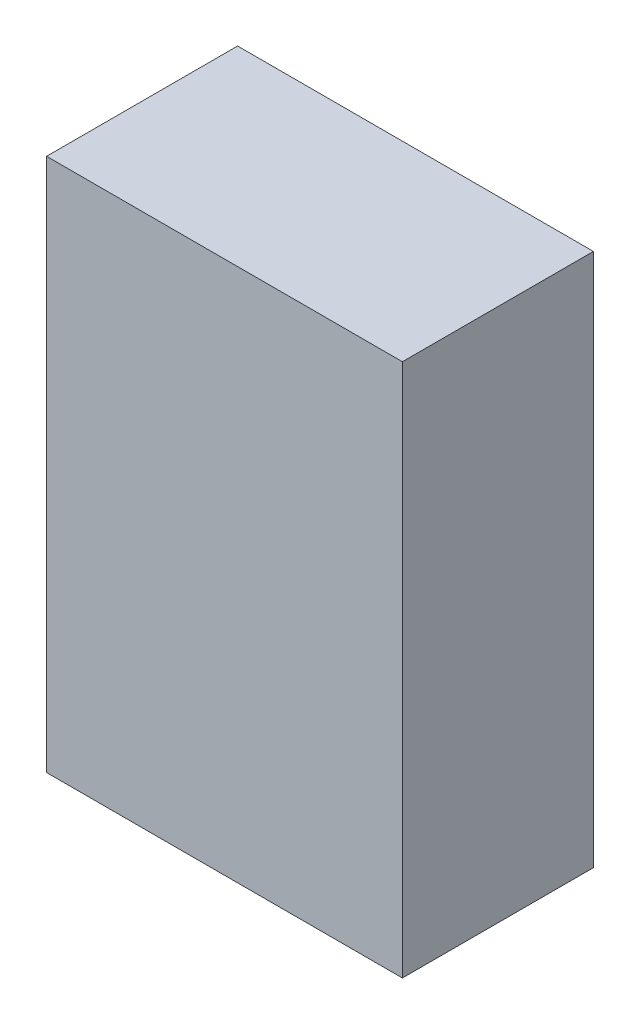
ISO-10303-21;
HEADER;
FILE_DESCRIPTION(('STEP AP214'),'2;1');
FILE_NAME('part.step','',(''),(''),'','','');
FILE_SCHEMA(('AUTOMOTIVE_DESIGN { 1 0 10303 214 1 1 1 1 }'));
ENDSEC;
DATA;
#1=APPLICATION_CONTEXT('core data for automotive mechanical design processes');
#2=APPLICATION_PROTOCOL_DEFINITION('international standard','automotive_design',2000,#1);
#3=PRODUCT_CONTEXT('',#1,'mechanical');
#4=PRODUCT('Part','Part','',(#3));
#5=PRODUCT_RELATED_PRODUCT_CATEGORY('part','',(#4));
#6=PRODUCT_DEFINITION_FORMATION('','',#4);
#7=PRODUCT_DEFINITION_CONTEXT('part definition',#1,'design');
#8=PRODUCT_DEFINITION('design','',#6,#7);
#9=PRODUCT_DEFINITION_SHAPE('','',#8);
#10=(LENGTH_UNIT() NAMED_UNIT(*) SI_UNIT(.MILLI.,.METRE.));
#11=(NAMED_UNIT(*) PLANE_ANGLE_UNIT() SI_UNIT($,.RADIAN.));
#12=(NAMED_UNIT(*) SI_UNIT($,.STERADIAN.) SOLID_ANGLE_UNIT());
#13=UNCERTAINTY_MEASURE_WITH_UNIT(LENGTH_MEASURE(1.E-05),#10,'distance_accuracy_value','');
#14=(GEOMETRIC_REPRESENTATION_CONTEXT(3) GLOBAL_UNCERTAINTY_ASSIGNED_CONTEXT((#13)) GLOBAL_UNIT_ASSIGNED_CONTEXT((#10,
#11,#12)) REPRESENTATION_CONTEXT('',''));
#15=CARTESIAN_POINT('',(0.,0.,0.));
#16=DIRECTION('',(0.,0.,1.));
#17=DIRECTION('',(1.,0.,0.));
#18=AXIS2_PLACEMENT_3D('',#15,#16,#17);
#19=CARTESIAN_POINT('',(0.,0.,0.2999994));
#20=DIRECTION('',(0.,0.,1.));
#21=DIRECTION('',(1.,0.,0.));
#22=AXIS2_PLACEMENT_3D('',#19,#20,#21);
#23=PLANE('',#22);
#24=DIRECTION('',(-1.,0.,0.));
#25=VECTOR('',#24,1.);
#26=CARTESIAN_POINT('',(0.2794,0.4191,0.2999994));
#27=LINE('',#26,#25);
#28=CARTESIAN_POINT('',(0.2794,0.4191,0.2999994));
#29=VERTEX_POINT('',#28);
#30=CARTESIAN_POINT('',(-0.2794,0.4191,0.2999994));
#31=VERTEX_POINT('',#30);
#32=EDGE_CURVE('E82',#29,#31,#27,.T.);
#33=ORIENTED_EDGE('',*,*,#32,.T.);
#34=DIRECTION('',(0.,-1.,0.));
#35=VECTOR('',#34,1.);
#36=CARTESIAN_POINT('',(-0.2794,0.4191,0.2999994));
#37=LINE('',#36,#35);
#38=CARTESIAN_POINT('',(-0.2794,-0.4191,0.2999994));
#39=VERTEX_POINT('',#38);
#40=EDGE_CURVE('E104',#31,#39,#37,.T.);
#41=ORIENTED_EDGE('',*,*,#40,.T.);
#42=DIRECTION('',(1.,0.,0.));
#43=VECTOR('',#42,1.);
#44=CARTESIAN_POINT('',(-0.2794,-0.4191,0.2999994));
#45=LINE('',#44,#43);
#46=CARTESIAN_POINT('',(0.2794,-0.4191,0.2999994));
#47=VERTEX_POINT('',#46);
#48=EDGE_CURVE('E74',#39,#47,#45,.T.);
#49=ORIENTED_EDGE('',*,*,#48,.T.);
#50=DIRECTION('',(0.,1.,0.));
#51=VECTOR('',#50,1.);
#52=CARTESIAN_POINT('',(0.2794,-0.4191,0.2999994));
#53=LINE('',#52,#51);
#54=EDGE_CURVE('E11',#47,#29,#53,.T.);
#55=ORIENTED_EDGE('',*,*,#54,.T.);
#56=EDGE_LOOP('',(#33,#41,#49,#55));
#57=FACE_BOUND('',#56,.T.);
#58=ADVANCED_FACE('F17',(#57),#23,.T.);
#59=CARTESIAN_POINT('',(0.,0.,0.));
#60=DIRECTION('',(0.,0.,1.));
#61=DIRECTION('',(1.,0.,0.));
#62=AXIS2_PLACEMENT_3D('',#59,#60,#61);
#63=PLANE('',#62);
#64=DIRECTION('',(0.,1.,0.));
#65=VECTOR('',#64,1.);
#66=CARTESIAN_POINT('',(0.2794,-0.4191,0.));
#67=LINE('',#66,#65);
#68=CARTESIAN_POINT('',(0.2794,-0.4191,0.));
#69=VERTEX_POINT('',#68);
#70=CARTESIAN_POINT('',(0.2794,0.4191,0.));
#71=VERTEX_POINT('',#70);
#72=EDGE_CURVE('E25',#69,#71,#67,.T.);
#73=ORIENTED_EDGE('',*,*,#72,.F.);
#74=DIRECTION('',(1.,0.,0.));
#75=VECTOR('',#74,1.);
#76=CARTESIAN_POINT('',(-0.2794,-0.4191,0.));
#77=LINE('',#76,#75);
#78=CARTESIAN_POINT('',(-0.2794,-0.4191,0.));
#79=VERTEX_POINT('',#78);
#80=EDGE_CURVE('E107',#79,#69,#77,.T.);
#81=ORIENTED_EDGE('',*,*,#80,.F.);
#82=DIRECTION('',(0.,-1.,0.));
#83=VECTOR('',#82,1.);
#84=CARTESIAN_POINT('',(-0.2794,0.4191,0.));
#85=LINE('',#84,#83);
#86=CARTESIAN_POINT('',(-0.2794,0.4191,0.));
#87=VERTEX_POINT('',#86);
#88=EDGE_CURVE('E84',#87,#79,#85,.T.);
#89=ORIENTED_EDGE('',*,*,#88,.F.);
#90=DIRECTION('',(-1.,0.,0.));
#91=VECTOR('',#90,1.);
#92=CARTESIAN_POINT('',(0.2794,0.4191,0.));
#93=LINE('',#92,#91);
#94=EDGE_CURVE('E80',#71,#87,#93,.T.);
#95=ORIENTED_EDGE('',*,*,#94,.F.);
#96=EDGE_LOOP('',(#73,#81,#89,#95));
#97=FACE_BOUND('',#96,.T.);
#98=ADVANCED_FACE('F86',(#97),#63,.F.);
#99=CARTESIAN_POINT('',(0.2794,-0.4191,0.));
#100=DIRECTION('',(-1.,0.,0.));
#101=DIRECTION('',(0.,0.,1.));
#102=AXIS2_PLACEMENT_3D('',#99,#100,#101);
#103=PLANE('',#102);
#104=ORIENTED_EDGE('',*,*,#72,.T.);
#105=DIRECTION('',(0.,0.,1.));
#106=VECTOR('',#105,1.);
#107=CARTESIAN_POINT('',(0.2794,0.4191,0.));
#108=LINE('',#107,#106);
#109=EDGE_CURVE('E68',#71,#29,#108,.T.);
#110=ORIENTED_EDGE('',*,*,#109,.T.);
#111=ORIENTED_EDGE('',*,*,#54,.F.);
#112=DIRECTION('',(0.,0.,1.));
#113=VECTOR('',#112,1.);
#114=CARTESIAN_POINT('',(0.2794,-0.4191,0.));
#115=LINE('',#114,#113);
#116=EDGE_CURVE('E71',#69,#47,#115,.T.);
#117=ORIENTED_EDGE('',*,*,#116,.F.);
#118=EDGE_LOOP('',(#104,#110,#111,#117));
#119=FACE_BOUND('',#118,.T.);
#120=ADVANCED_FACE('F67',(#119),#103,.F.);
#121=CARTESIAN_POINT('',(-0.2794,-0.4191,0.));
#122=DIRECTION('',(0.,1.,0.));
#123=DIRECTION('',(1.,0.,0.));
#124=AXIS2_PLACEMENT_3D('',#121,#122,#123);
#125=PLANE('',#124);
#126=ORIENTED_EDGE('',*,*,#80,.T.);
#127=ORIENTED_EDGE('',*,*,#116,.T.);
#128=ORIENTED_EDGE('',*,*,#48,.F.);
#129=DIRECTION('',(0.,0.,1.));
#130=VECTOR('',#129,1.);
#131=CARTESIAN_POINT('',(-0.2794,-0.4191,0.));
#132=LINE('',#131,#130);
#133=EDGE_CURVE('E100',#79,#39,#132,.T.);
#134=ORIENTED_EDGE('',*,*,#133,.F.);
#135=EDGE_LOOP('',(#126,#127,#128,#134));
#136=FACE_BOUND('',#135,.T.);
#137=ADVANCED_FACE('F117',(#136),#125,.F.);
#138=CARTESIAN_POINT('',(-0.2794,0.4191,0.));
#139=DIRECTION('',(1.,0.,0.));
#140=DIRECTION('',(0.,1.,0.));
#141=AXIS2_PLACEMENT_3D('',#138,#139,#140);
#142=PLANE('',#141);
#143=ORIENTED_EDGE('',*,*,#88,.T.);
#144=ORIENTED_EDGE('',*,*,#133,.T.);
#145=ORIENTED_EDGE('',*,*,#40,.F.);
#146=DIRECTION('',(0.,0.,1.));
#147=VECTOR('',#146,1.);
#148=CARTESIAN_POINT('',(-0.2794,0.4191,0.));
#149=LINE('',#148,#147);
#150=EDGE_CURVE('E90',#87,#31,#149,.T.);
#151=ORIENTED_EDGE('',*,*,#150,.F.);
#152=EDGE_LOOP('',(#143,#144,#145,#151));
#153=FACE_BOUND('',#152,.T.);
#154=ADVANCED_FACE('F119',(#153),#142,.F.);
#155=CARTESIAN_POINT('',(0.2794,0.4191,0.));
#156=DIRECTION('',(0.,-1.,0.));
#157=DIRECTION('',(0.,0.,-1.));
#158=AXIS2_PLACEMENT_3D('',#155,#156,#157);
#159=PLANE('',#158);
#160=ORIENTED_EDGE('',*,*,#94,.T.);
#161=ORIENTED_EDGE('',*,*,#150,.T.);
#162=ORIENTED_EDGE('',*,*,#32,.F.);
#163=ORIENTED_EDGE('',*,*,#109,.F.);
#164=EDGE_LOOP('',(#160,#161,#162,#163));
#165=FACE_BOUND('',#164,.T.);
#166=ADVANCED_FACE('F78',(#165),#159,.F.);
#167=CLOSED_SHELL('',(#58,#98,#120,#137,#154,#166));
#168=MANIFOLD_SOLID_BREP('B1',#167);
#169=ADVANCED_BREP_SHAPE_REPRESENTATION('',(#18,#168),#14);
#170=SHAPE_DEFINITION_REPRESENTATION(#9,#169);
ENDSEC;
END-ISO-10303-21;
